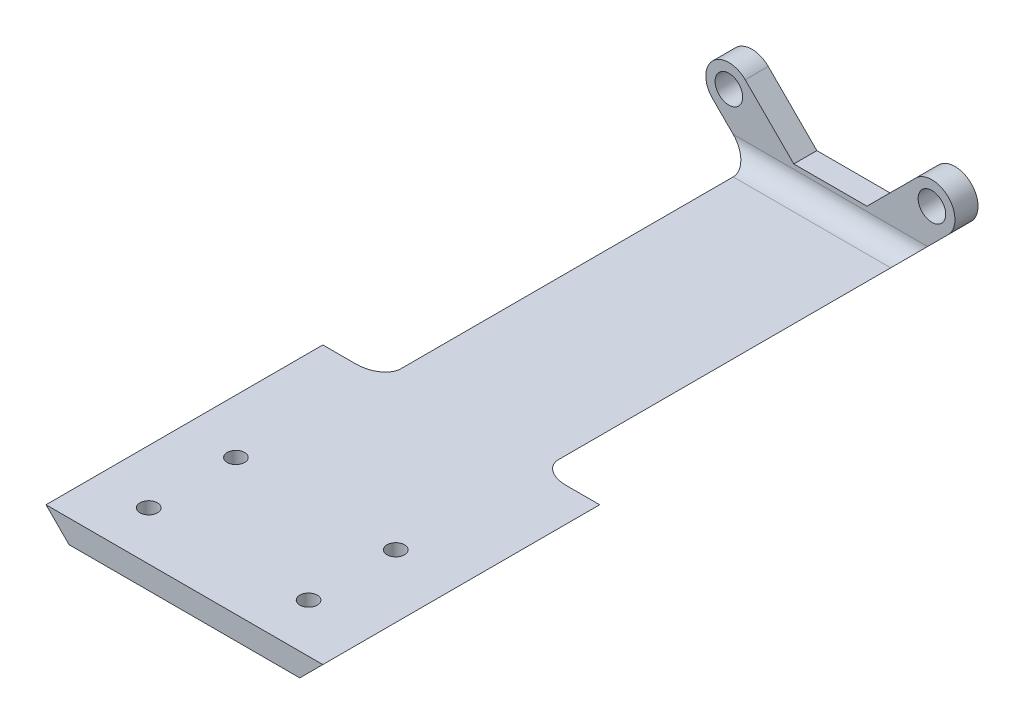
ISO-10303-21;
HEADER;
FILE_DESCRIPTION(('STEP AP214'),'2;1');
FILE_NAME('part.step','',(''),(''),'','','');
FILE_SCHEMA(('AUTOMOTIVE_DESIGN { 1 0 10303 214 1 1 1 1 }'));
ENDSEC;
DATA;
#1=APPLICATION_CONTEXT('core data for automotive mechanical design processes');
#2=APPLICATION_PROTOCOL_DEFINITION('international standard','automotive_design',2000,#1);
#3=PRODUCT_CONTEXT('',#1,'mechanical');
#4=PRODUCT('Part','Part','',(#3));
#5=PRODUCT_RELATED_PRODUCT_CATEGORY('part','',(#4));
#6=PRODUCT_DEFINITION_FORMATION('','',#4);
#7=PRODUCT_DEFINITION_CONTEXT('part definition',#1,'design');
#8=PRODUCT_DEFINITION('design','',#6,#7);
#9=PRODUCT_DEFINITION_SHAPE('','',#8);
#10=(LENGTH_UNIT() NAMED_UNIT(*) SI_UNIT(.MILLI.,.METRE.));
#11=(NAMED_UNIT(*) PLANE_ANGLE_UNIT() SI_UNIT($,.RADIAN.));
#12=(NAMED_UNIT(*) SI_UNIT($,.STERADIAN.) SOLID_ANGLE_UNIT());
#13=UNCERTAINTY_MEASURE_WITH_UNIT(LENGTH_MEASURE(1.E-05),#10,'distance_accuracy_value','');
#14=(GEOMETRIC_REPRESENTATION_CONTEXT(3) GLOBAL_UNCERTAINTY_ASSIGNED_CONTEXT((#13)) GLOBAL_UNIT_ASSIGNED_CONTEXT((#10,
#11,#12)) REPRESENTATION_CONTEXT('',''));
#15=CARTESIAN_POINT('',(0.,0.,0.));
#16=DIRECTION('',(0.,0.,1.));
#17=DIRECTION('',(1.,0.,0.));
#18=AXIS2_PLACEMENT_3D('',#15,#16,#17);
#19=CARTESIAN_POINT('',(0.,0.,3.175));
#20=DIRECTION('',(0.,0.,-1.));
#21=DIRECTION('',(-1.,0.,0.));
#22=AXIS2_PLACEMENT_3D('',#19,#20,#21);
#23=CYLINDRICAL_SURFACE('',#22,3.175);
#24=CARTESIAN_POINT('',(0.,0.,0.));
#25=DIRECTION('',(0.,0.,1.));
#26=DIRECTION('',(-1.,0.,0.));
#27=AXIS2_PLACEMENT_3D('',#24,#25,#26);
#28=CIRCLE('',#27,3.175);
#29=CARTESIAN_POINT('',(2.24506403026729,2.24506403026729,0.));
#30=VERTEX_POINT('',#29);
#31=CARTESIAN_POINT('',(-2.24506403026729,-2.24506403026729,0.));
#32=VERTEX_POINT('',#31);
#33=EDGE_CURVE('E247',#30,#32,#28,.T.);
#34=ORIENTED_EDGE('',*,*,#33,.T.);
#35=DIRECTION('',(0.,0.,-1.));
#36=VECTOR('',#35,1.);
#37=CARTESIAN_POINT('',(-2.24506403026729,-2.24506403026729,3.175));
#38=LINE('',#37,#36);
#39=CARTESIAN_POINT('',(-2.24506403026729,-2.24506403026729,3.175));
#40=VERTEX_POINT('',#39);
#41=EDGE_CURVE('E211',#40,#32,#38,.T.);
#42=ORIENTED_EDGE('',*,*,#41,.F.);
#43=CARTESIAN_POINT('',(0.,0.,3.175));
#44=DIRECTION('',(0.,0.,1.));
#45=DIRECTION('',(-1.,0.,0.));
#46=AXIS2_PLACEMENT_3D('',#43,#44,#45);
#47=CIRCLE('',#46,3.175);
#48=CARTESIAN_POINT('',(2.24506403026729,2.24506403026729,3.175));
#49=VERTEX_POINT('',#48);
#50=EDGE_CURVE('E266',#49,#40,#47,.T.);
#51=ORIENTED_EDGE('',*,*,#50,.F.);
#52=DIRECTION('',(0.,0.,-1.));
#53=VECTOR('',#52,1.);
#54=CARTESIAN_POINT('',(2.24506403026729,2.24506403026729,3.175));
#55=LINE('',#54,#53);
#56=EDGE_CURVE('E246',#49,#30,#55,.T.);
#57=ORIENTED_EDGE('',*,*,#56,.T.);
#58=EDGE_LOOP('',(#34,#42,#51,#57));
#59=FACE_BOUND('',#58,.T.);
#60=ADVANCED_FACE('F35',(#59),#23,.T.);
#61=CARTESIAN_POINT('',(-2.24506403026729,-2.24506403026729,3.175));
#62=DIRECTION('',(0.707106781186547,0.707106781186548,0.));
#63=DIRECTION('',(-0.707106781186548,0.707106781186547,0.));
#64=AXIS2_PLACEMENT_3D('',#61,#62,#63);
#65=PLANE('',#64);
#66=DIRECTION('',(0.,0.,-1.));
#67=VECTOR('',#66,1.);
#68=CARTESIAN_POINT('',(6.30487193946542,-10.795,3.175));
#69=LINE('',#68,#67);
#70=CARTESIAN_POINT('',(6.30487193946542,-10.795,51.435));
#71=VERTEX_POINT('',#70);
#72=CARTESIAN_POINT('',(6.30487193946542,-10.795,0.));
#73=VERTEX_POINT('',#72);
#74=EDGE_CURVE('E209',#71,#73,#69,.T.);
#75=ORIENTED_EDGE('',*,*,#74,.F.);
#76=DIRECTION('',(0.707106781186548,-0.707106781186547,0.));
#77=VECTOR('',#76,1.);
#78=CARTESIAN_POINT('',(3.12987193946542,-7.62,51.435));
#79=LINE('',#78,#77);
#80=CARTESIAN_POINT('',(3.12987193946543,-7.62,51.435));
#81=VERTEX_POINT('',#80);
#82=EDGE_CURVE('E207',#71,#81,#79,.F.);
#83=ORIENTED_EDGE('',*,*,#82,.T.);
#84=DIRECTION('',(0.,0.,-1.));
#85=VECTOR('',#84,1.);
#86=CARTESIAN_POINT('',(3.12987193946543,-7.62,53.975));
#87=LINE('',#86,#85);
#88=CARTESIAN_POINT('',(3.12987193946543,-7.62,5.715));
#89=VERTEX_POINT('',#88);
#90=EDGE_CURVE('E213',#81,#89,#87,.T.);
#91=ORIENTED_EDGE('',*,*,#90,.T.);
#92=CARTESIAN_POINT('',(0.589871939465422,-5.08,5.715));
#93=DIRECTION('',(0.707106781186547,0.707106781186548,0.));
#94=DIRECTION('',(0.707106781186548,-0.707106781186547,0.));
#95=AXIS2_PLACEMENT_3D('',#92,#93,#94);
#96=ELLIPSE('',#95,3.59210244842766,2.54);
#97=CARTESIAN_POINT('',(0.589871939465422,-5.08,3.175));
#98=VERTEX_POINT('',#97);
#99=EDGE_CURVE('E208',#89,#98,#96,.T.);
#100=ORIENTED_EDGE('',*,*,#99,.T.);
#101=DIRECTION('',(0.707106781186548,-0.707106781186547,0.));
#102=VECTOR('',#101,1.);
#103=CARTESIAN_POINT('',(-2.24506403026729,-2.24506403026729,3.175));
#104=LINE('',#103,#102);
#105=EDGE_CURVE('E231',#40,#98,#104,.T.);
#106=ORIENTED_EDGE('',*,*,#105,.F.);
#107=ORIENTED_EDGE('',*,*,#41,.T.);
#108=DIRECTION('',(0.707106781186548,-0.707106781186547,0.));
#109=VECTOR('',#108,1.);
#110=CARTESIAN_POINT('',(-2.24506403026729,-2.24506403026729,0.));
#111=LINE('',#110,#109);
#112=EDGE_CURVE('E250',#32,#73,#111,.T.);
#113=ORIENTED_EDGE('',*,*,#112,.T.);
#114=EDGE_LOOP('',(#75,#83,#91,#100,#106,#107,#113));
#115=FACE_BOUND('',#114,.T.);
#116=ADVANCED_FACE('F307',(#115),#65,.F.);
#117=CARTESIAN_POINT('',(6.30487193946542,-10.795,3.175));
#118=DIRECTION('',(0.,1.,0.));
#119=DIRECTION('',(0.,0.,1.));
#120=AXIS2_PLACEMENT_3D('',#117,#118,#119);
#121=PLANE('',#120);
#122=CARTESIAN_POINT('',(2.3543052808631,-10.795,85.375));
#123=DIRECTION('',(0.,1.,0.));
#124=DIRECTION('',(0.,0.,1.));
#125=AXIS2_PLACEMENT_3D('',#122,#123,#124);
#126=CIRCLE('',#125,1.19999999999999);
#127=CARTESIAN_POINT('',(2.3543052808631,-10.795,86.575));
#128=VERTEX_POINT('',#127);
#129=EDGE_CURVE('E347',#128,#128,#126,.T.);
#130=ORIENTED_EDGE('',*,*,#129,.T.);
#131=EDGE_LOOP('',(#130));
#132=FACE_BOUND('',#131,.T.);
#133=CARTESIAN_POINT('',(2.3543052808631,-10.795,73.375));
#134=DIRECTION('',(0.,1.,0.));
#135=DIRECTION('',(0.,0.,1.));
#136=AXIS2_PLACEMENT_3D('',#133,#134,#135);
#137=CIRCLE('',#136,1.19999999999999);
#138=CARTESIAN_POINT('',(2.3543052808631,-10.795,74.575));
#139=VERTEX_POINT('',#138);
#140=EDGE_CURVE('E341',#139,#139,#137,.T.);
#141=ORIENTED_EDGE('',*,*,#140,.T.);
#142=EDGE_LOOP('',(#141));
#143=FACE_BOUND('',#142,.T.);
#144=CARTESIAN_POINT('',(24.3543052808631,-10.795,85.375));
#145=DIRECTION('',(0.,1.,0.));
#146=DIRECTION('',(0.,0.,1.));
#147=AXIS2_PLACEMENT_3D('',#144,#145,#146);
#148=CIRCLE('',#147,1.19999999999999);
#149=CARTESIAN_POINT('',(24.3543052808631,-10.795,86.575));
#150=VERTEX_POINT('',#149);
#151=EDGE_CURVE('E335',#150,#150,#148,.T.);
#152=ORIENTED_EDGE('',*,*,#151,.T.);
#153=EDGE_LOOP('',(#152));
#154=FACE_BOUND('',#153,.T.);
#155=CARTESIAN_POINT('',(24.3543052808631,-10.795,73.375));
#156=DIRECTION('',(0.,1.,0.));
#157=DIRECTION('',(0.,0.,1.));
#158=AXIS2_PLACEMENT_3D('',#155,#156,#157);
#159=CIRCLE('',#158,1.19999999999999);
#160=CARTESIAN_POINT('',(24.3543052808631,-10.795,74.575));
#161=VERTEX_POINT('',#160);
#162=EDGE_CURVE('E327',#161,#161,#159,.T.);
#163=ORIENTED_EDGE('',*,*,#162,.T.);
#164=EDGE_LOOP('',(#163));
#165=FACE_BOUND('',#164,.T.);
#166=DIRECTION('',(1.,0.,0.));
#167=VECTOR('',#166,1.);
#168=CARTESIAN_POINT('',(6.30487193946542,-10.795,0.));
#169=LINE('',#168,#167);
#170=CARTESIAN_POINT('',(21.6351280605346,-10.795,0.));
#171=VERTEX_POINT('',#170);
#172=EDGE_CURVE('E254',#73,#171,#169,.T.);
#173=ORIENTED_EDGE('',*,*,#172,.T.);
#174=DIRECTION('',(0.,0.,-1.));
#175=VECTOR('',#174,1.);
#176=CARTESIAN_POINT('',(21.6351280605346,-10.795,3.175));
#177=LINE('',#176,#175);
#178=CARTESIAN_POINT('',(21.6351280605346,-10.795,51.435));
#179=VERTEX_POINT('',#178);
#180=EDGE_CURVE('E212',#179,#171,#177,.T.);
#181=ORIENTED_EDGE('',*,*,#180,.F.);
#182=CARTESIAN_POINT('',(25.2272305089622,-10.795,51.435));
#183=DIRECTION('',(0.,1.,0.));
#184=DIRECTION('',(-1.,0.,0.));
#185=AXIS2_PLACEMENT_3D('',#182,#183,#184);
#186=ELLIPSE('',#185,3.59210244842766,2.54);
#187=CARTESIAN_POINT('',(25.2272305089622,-10.795,53.975));
#188=VERTEX_POINT('',#187);
#189=EDGE_CURVE('E11',#179,#188,#186,.T.);
#190=ORIENTED_EDGE('',*,*,#189,.T.);
#191=DIRECTION('',(1.,0.,0.));
#192=VECTOR('',#191,1.);
#193=CARTESIAN_POINT('',(29.8449950394654,-10.795,53.975));
#194=LINE('',#193,#192);
#195=CARTESIAN_POINT('',(29.8449950394654,-10.795,53.975));
#196=VERTEX_POINT('',#195);
#197=EDGE_CURVE('E322',#188,#196,#194,.T.);
#198=ORIENTED_EDGE('',*,*,#197,.T.);
#199=DIRECTION('',(0.,0.,-1.));
#200=VECTOR('',#199,1.);
#201=CARTESIAN_POINT('',(29.8449950394654,-10.795,92.075));
#202=LINE('',#201,#200);
#203=CARTESIAN_POINT('',(29.8449950394654,-10.795,92.075));
#204=VERTEX_POINT('',#203);
#205=EDGE_CURVE('E161',#204,#196,#202,.T.);
#206=ORIENTED_EDGE('',*,*,#205,.F.);
#207=DIRECTION('',(1.,0.,0.));
#208=VECTOR('',#207,1.);
#209=CARTESIAN_POINT('',(29.8449950394654,-10.795,92.075));
#210=LINE('',#209,#208);
#211=CARTESIAN_POINT('',(-1.90500496053457,-10.795,92.075));
#212=VERTEX_POINT('',#211);
#213=EDGE_CURVE('E152',#212,#204,#210,.T.);
#214=ORIENTED_EDGE('',*,*,#213,.F.);
#215=DIRECTION('',(0.,0.,-1.));
#216=VECTOR('',#215,1.);
#217=CARTESIAN_POINT('',(-1.90500496053457,-10.795,92.075));
#218=LINE('',#217,#216);
#219=CARTESIAN_POINT('',(-1.90500496053457,-10.795,53.975));
#220=VERTEX_POINT('',#219);
#221=EDGE_CURVE('E158',#212,#220,#218,.T.);
#222=ORIENTED_EDGE('',*,*,#221,.T.);
#223=CARTESIAN_POINT('',(2.71276949103777,-10.795,53.975));
#224=VERTEX_POINT('',#223);
#225=EDGE_CURVE('E191',#220,#224,#194,.T.);
#226=ORIENTED_EDGE('',*,*,#225,.T.);
#227=CARTESIAN_POINT('',(2.71276949103777,-10.795,51.435));
#228=DIRECTION('',(0.,1.,0.));
#229=DIRECTION('',(-1.,0.,0.));
#230=AXIS2_PLACEMENT_3D('',#227,#228,#229);
#231=ELLIPSE('',#230,3.59210244842766,2.54);
#232=EDGE_CURVE('E292',#224,#71,#231,.T.);
#233=ORIENTED_EDGE('',*,*,#232,.T.);
#234=ORIENTED_EDGE('',*,*,#74,.T.);
#235=EDGE_LOOP('',(#173,#181,#190,#198,#206,#214,#222,#226,#233,#234));
#236=FACE_BOUND('',#235,.T.);
#237=ADVANCED_FACE('F155',(#132,#143,#154,#165,#236),#121,.F.);
#238=CARTESIAN_POINT('',(21.6351280605346,-10.795,3.175));
#239=DIRECTION('',(-0.707106781186547,0.707106781186548,0.));
#240=DIRECTION('',(-0.707106781186548,-0.707106781186547,0.));
#241=AXIS2_PLACEMENT_3D('',#238,#239,#240);
#242=PLANE('',#241);
#243=DIRECTION('',(0.,0.,-1.));
#244=VECTOR('',#243,1.);
#245=CARTESIAN_POINT('',(24.8101280605346,-7.62,53.975));
#246=LINE('',#245,#244);
#247=CARTESIAN_POINT('',(24.8101280605346,-7.62,51.435));
#248=VERTEX_POINT('',#247);
#249=CARTESIAN_POINT('',(24.8101280605346,-7.62,5.715));
#250=VERTEX_POINT('',#249);
#251=EDGE_CURVE('E251',#248,#250,#246,.T.);
#252=ORIENTED_EDGE('',*,*,#251,.F.);
#253=DIRECTION('',(0.707106781186548,0.707106781186547,0.));
#254=VECTOR('',#253,1.);
#255=CARTESIAN_POINT('',(21.6351280605346,-10.795,51.435));
#256=LINE('',#255,#254);
#257=EDGE_CURVE('E50',#248,#179,#256,.F.);
#258=ORIENTED_EDGE('',*,*,#257,.T.);
#259=ORIENTED_EDGE('',*,*,#180,.T.);
#260=DIRECTION('',(0.707106781186548,0.707106781186547,0.));
#261=VECTOR('',#260,1.);
#262=CARTESIAN_POINT('',(21.6351280605346,-10.795,0.));
#263=LINE('',#262,#261);
#264=CARTESIAN_POINT('',(30.1850640302673,-2.24506403026729,0.));
#265=VERTEX_POINT('',#264);
#266=EDGE_CURVE('E256',#171,#265,#263,.T.);
#267=ORIENTED_EDGE('',*,*,#266,.T.);
#268=DIRECTION('',(0.,0.,-1.));
#269=VECTOR('',#268,1.);
#270=CARTESIAN_POINT('',(30.1850640302673,-2.24506403026729,3.175));
#271=LINE('',#270,#269);
#272=CARTESIAN_POINT('',(30.1850640302673,-2.24506403026729,3.175));
#273=VERTEX_POINT('',#272);
#274=EDGE_CURVE('E278',#273,#265,#271,.T.);
#275=ORIENTED_EDGE('',*,*,#274,.F.);
#276=DIRECTION('',(0.707106781186548,0.707106781186547,0.));
#277=VECTOR('',#276,1.);
#278=CARTESIAN_POINT('',(21.6351280605346,-10.795,3.175));
#279=LINE('',#278,#277);
#280=CARTESIAN_POINT('',(27.3501280605346,-5.08,3.175));
#281=VERTEX_POINT('',#280);
#282=EDGE_CURVE('E228',#281,#273,#279,.T.);
#283=ORIENTED_EDGE('',*,*,#282,.F.);
#284=CARTESIAN_POINT('',(27.3501280605346,-5.08,5.715));
#285=DIRECTION('',(-0.707106781186547,0.707106781186548,0.));
#286=DIRECTION('',(0.707106781186548,0.707106781186547,0.));
#287=AXIS2_PLACEMENT_3D('',#284,#285,#286);
#288=ELLIPSE('',#287,3.59210244842766,2.54);
#289=EDGE_CURVE('E219',#281,#250,#288,.T.);
#290=ORIENTED_EDGE('',*,*,#289,.T.);
#291=EDGE_LOOP('',(#252,#258,#259,#267,#275,#283,#290));
#292=FACE_BOUND('',#291,.T.);
#293=ADVANCED_FACE('F375',(#292),#242,.F.);
#294=CARTESIAN_POINT('',(27.94,0.,3.175));
#295=DIRECTION('',(0.,0.,-1.));
#296=DIRECTION('',(-1.,0.,0.));
#297=AXIS2_PLACEMENT_3D('',#294,#295,#296);
#298=CYLINDRICAL_SURFACE('',#297,3.175);
#299=CARTESIAN_POINT('',(27.94,0.,0.));
#300=DIRECTION('',(0.,0.,1.));
#301=DIRECTION('',(1.,0.,0.));
#302=AXIS2_PLACEMENT_3D('',#299,#300,#301);
#303=CIRCLE('',#302,3.175);
#304=CARTESIAN_POINT('',(25.6949359697327,2.24506403026729,0.));
#305=VERTEX_POINT('',#304);
#306=EDGE_CURVE('E258',#265,#305,#303,.T.);
#307=ORIENTED_EDGE('',*,*,#306,.T.);
#308=DIRECTION('',(0.,0.,-1.));
#309=VECTOR('',#308,1.);
#310=CARTESIAN_POINT('',(25.6949359697327,2.24506403026729,3.175));
#311=LINE('',#310,#309);
#312=CARTESIAN_POINT('',(25.6949359697327,2.24506403026729,3.175));
#313=VERTEX_POINT('',#312);
#314=EDGE_CURVE('E275',#313,#305,#311,.T.);
#315=ORIENTED_EDGE('',*,*,#314,.F.);
#316=CARTESIAN_POINT('',(27.94,0.,3.175));
#317=DIRECTION('',(0.,0.,1.));
#318=DIRECTION('',(1.,0.,0.));
#319=AXIS2_PLACEMENT_3D('',#316,#317,#318);
#320=CIRCLE('',#319,3.175);
#321=EDGE_CURVE('E230',#273,#313,#320,.T.);
#322=ORIENTED_EDGE('',*,*,#321,.F.);
#323=ORIENTED_EDGE('',*,*,#274,.T.);
#324=EDGE_LOOP('',(#307,#315,#322,#323));
#325=FACE_BOUND('',#324,.T.);
#326=ADVANCED_FACE('F382',(#325),#298,.T.);
#327=CARTESIAN_POINT('',(19.0048719394654,-4.445,3.175));
#328=DIRECTION('',(0.707106781186548,-0.707106781186547,0.));
#329=DIRECTION('',(0.707106781186547,0.707106781186548,0.));
#330=AXIS2_PLACEMENT_3D('',#327,#328,#329);
#331=PLANE('',#330);
#332=DIRECTION('',(-0.707106781186547,-0.707106781186548,0.));
#333=VECTOR('',#332,1.);
#334=CARTESIAN_POINT('',(19.0048719394654,-4.445,0.));
#335=LINE('',#334,#333);
#336=CARTESIAN_POINT('',(19.0048719394654,-4.445,0.));
#337=VERTEX_POINT('',#336);
#338=EDGE_CURVE('E260',#305,#337,#335,.T.);
#339=ORIENTED_EDGE('',*,*,#338,.T.);
#340=DIRECTION('',(0.,0.,-1.));
#341=VECTOR('',#340,1.);
#342=CARTESIAN_POINT('',(19.0048719394654,-4.445,3.175));
#343=LINE('',#342,#341);
#344=CARTESIAN_POINT('',(19.0048719394654,-4.445,3.175));
#345=VERTEX_POINT('',#344);
#346=EDGE_CURVE('E272',#345,#337,#343,.T.);
#347=ORIENTED_EDGE('',*,*,#346,.F.);
#348=DIRECTION('',(-0.707106781186547,-0.707106781186548,0.));
#349=VECTOR('',#348,1.);
#350=CARTESIAN_POINT('',(19.0048719394654,-4.445,3.175));
#351=LINE('',#350,#349);
#352=EDGE_CURVE('E240',#313,#345,#351,.T.);
#353=ORIENTED_EDGE('',*,*,#352,.F.);
#354=ORIENTED_EDGE('',*,*,#314,.T.);
#355=EDGE_LOOP('',(#339,#347,#353,#354));
#356=FACE_BOUND('',#355,.T.);
#357=ADVANCED_FACE('F435',(#356),#331,.F.);
#358=CARTESIAN_POINT('',(8.93512806053458,-4.445,3.175));
#359=DIRECTION('',(0.,-1.,0.));
#360=DIRECTION('',(0.,0.,-1.));
#361=AXIS2_PLACEMENT_3D('',#358,#359,#360);
#362=PLANE('',#361);
#363=DIRECTION('',(-1.,0.,0.));
#364=VECTOR('',#363,1.);
#365=CARTESIAN_POINT('',(8.93512806053458,-4.445,0.));
#366=LINE('',#365,#364);
#367=CARTESIAN_POINT('',(8.93512806053458,-4.445,0.));
#368=VERTEX_POINT('',#367);
#369=EDGE_CURVE('E262',#337,#368,#366,.T.);
#370=ORIENTED_EDGE('',*,*,#369,.T.);
#371=DIRECTION('',(0.,0.,-1.));
#372=VECTOR('',#371,1.);
#373=CARTESIAN_POINT('',(8.93512806053458,-4.445,3.175));
#374=LINE('',#373,#372);
#375=CARTESIAN_POINT('',(8.93512806053458,-4.445,3.175));
#376=VERTEX_POINT('',#375);
#377=EDGE_CURVE('E269',#376,#368,#374,.T.);
#378=ORIENTED_EDGE('',*,*,#377,.F.);
#379=DIRECTION('',(-1.,0.,0.));
#380=VECTOR('',#379,1.);
#381=CARTESIAN_POINT('',(8.93512806053458,-4.445,3.175));
#382=LINE('',#381,#380);
#383=EDGE_CURVE('E242',#345,#376,#382,.T.);
#384=ORIENTED_EDGE('',*,*,#383,.F.);
#385=ORIENTED_EDGE('',*,*,#346,.T.);
#386=EDGE_LOOP('',(#370,#378,#384,#385));
#387=FACE_BOUND('',#386,.T.);
#388=ADVANCED_FACE('F431',(#387),#362,.F.);
#389=CARTESIAN_POINT('',(2.24506403026729,2.24506403026729,3.175));
#390=DIRECTION('',(-0.707106781186548,-0.707106781186548,0.));
#391=DIRECTION('',(0.707106781186548,-0.707106781186548,0.));
#392=AXIS2_PLACEMENT_3D('',#389,#390,#391);
#393=PLANE('',#392);
#394=DIRECTION('',(-0.707106781186547,0.707106781186547,0.));
#395=VECTOR('',#394,1.);
#396=CARTESIAN_POINT('',(2.24506403026729,2.24506403026729,0.));
#397=LINE('',#396,#395);
#398=EDGE_CURVE('E264',#368,#30,#397,.T.);
#399=ORIENTED_EDGE('',*,*,#398,.T.);
#400=ORIENTED_EDGE('',*,*,#56,.F.);
#401=DIRECTION('',(-0.707106781186547,0.707106781186547,0.));
#402=VECTOR('',#401,1.);
#403=CARTESIAN_POINT('',(2.24506403026729,2.24506403026729,3.175));
#404=LINE('',#403,#402);
#405=EDGE_CURVE('E244',#376,#49,#404,.T.);
#406=ORIENTED_EDGE('',*,*,#405,.F.);
#407=ORIENTED_EDGE('',*,*,#377,.T.);
#408=EDGE_LOOP('',(#399,#400,#406,#407));
#409=FACE_BOUND('',#408,.T.);
#410=ADVANCED_FACE('F424',(#409),#393,.F.);
#411=CARTESIAN_POINT('',(0.,0.,3.175));
#412=DIRECTION('',(0.,0.,-1.));
#413=DIRECTION('',(-1.,0.,0.));
#414=AXIS2_PLACEMENT_3D('',#411,#412,#413);
#415=PLANE('',#414);
#416=CARTESIAN_POINT('',(27.94,0.,3.175));
#417=DIRECTION('',(0.,0.,-1.));
#418=DIRECTION('',(-1.,0.,0.));
#419=AXIS2_PLACEMENT_3D('',#416,#417,#418);
#420=CIRCLE('',#419,1.89864999999999);
#421=CARTESIAN_POINT('',(26.04135,0.,3.175));
#422=VERTEX_POINT('',#421);
#423=EDGE_CURVE('E182',#422,#422,#420,.T.);
#424=ORIENTED_EDGE('',*,*,#423,.T.);
#425=EDGE_LOOP('',(#424));
#426=FACE_BOUND('',#425,.T.);
#427=CARTESIAN_POINT('',(0.,0.,3.175));
#428=DIRECTION('',(0.,0.,-1.));
#429=DIRECTION('',(-1.,0.,0.));
#430=AXIS2_PLACEMENT_3D('',#427,#428,#429);
#431=CIRCLE('',#430,1.89864999999999);
#432=CARTESIAN_POINT('',(-1.89864999999999,0.,3.175));
#433=VERTEX_POINT('',#432);
#434=EDGE_CURVE('E463',#433,#433,#431,.T.);
#435=ORIENTED_EDGE('',*,*,#434,.T.);
#436=EDGE_LOOP('',(#435));
#437=FACE_BOUND('',#436,.T.);
#438=ORIENTED_EDGE('',*,*,#105,.T.);
#439=DIRECTION('',(1.,0.,0.));
#440=VECTOR('',#439,1.);
#441=CARTESIAN_POINT('',(0.,-5.08,3.175));
#442=LINE('',#441,#440);
#443=EDGE_CURVE('E225',#98,#281,#442,.T.);
#444=ORIENTED_EDGE('',*,*,#443,.T.);
#445=ORIENTED_EDGE('',*,*,#282,.T.);
#446=ORIENTED_EDGE('',*,*,#321,.T.);
#447=ORIENTED_EDGE('',*,*,#352,.T.);
#448=ORIENTED_EDGE('',*,*,#383,.T.);
#449=ORIENTED_EDGE('',*,*,#405,.T.);
#450=ORIENTED_EDGE('',*,*,#50,.T.);
#451=EDGE_LOOP('',(#438,#444,#445,#446,#447,#448,#449,#450));
#452=FACE_BOUND('',#451,.T.);
#453=ADVANCED_FACE('F421',(#426,#437,#452),#415,.F.);
#454=CARTESIAN_POINT('',(0.,0.,0.));
#455=DIRECTION('',(0.,0.,-1.));
#456=DIRECTION('',(-1.,0.,0.));
#457=AXIS2_PLACEMENT_3D('',#454,#455,#456);
#458=PLANE('',#457);
#459=CARTESIAN_POINT('',(27.94,0.,0.));
#460=DIRECTION('',(0.,0.,-1.));
#461=DIRECTION('',(-1.,0.,0.));
#462=AXIS2_PLACEMENT_3D('',#459,#460,#461);
#463=CIRCLE('',#462,1.89864999999999);
#464=CARTESIAN_POINT('',(26.04135,0.,0.));
#465=VERTEX_POINT('',#464);
#466=EDGE_CURVE('E179',#465,#465,#463,.T.);
#467=ORIENTED_EDGE('',*,*,#466,.F.);
#468=EDGE_LOOP('',(#467));
#469=FACE_BOUND('',#468,.T.);
#470=CARTESIAN_POINT('',(0.,0.,0.));
#471=DIRECTION('',(0.,0.,-1.));
#472=DIRECTION('',(-1.,0.,0.));
#473=AXIS2_PLACEMENT_3D('',#470,#471,#472);
#474=CIRCLE('',#473,1.89864999999999);
#475=CARTESIAN_POINT('',(-1.89864999999999,0.,0.));
#476=VERTEX_POINT('',#475);
#477=EDGE_CURVE('E465',#476,#476,#474,.T.);
#478=ORIENTED_EDGE('',*,*,#477,.F.);
#479=EDGE_LOOP('',(#478));
#480=FACE_BOUND('',#479,.T.);
#481=ORIENTED_EDGE('',*,*,#33,.F.);
#482=ORIENTED_EDGE('',*,*,#398,.F.);
#483=ORIENTED_EDGE('',*,*,#369,.F.);
#484=ORIENTED_EDGE('',*,*,#338,.F.);
#485=ORIENTED_EDGE('',*,*,#306,.F.);
#486=ORIENTED_EDGE('',*,*,#266,.F.);
#487=ORIENTED_EDGE('',*,*,#172,.F.);
#488=ORIENTED_EDGE('',*,*,#112,.F.);
#489=EDGE_LOOP('',(#481,#482,#483,#484,#485,#486,#487,#488));
#490=FACE_BOUND('',#489,.T.);
#491=ADVANCED_FACE('F313',(#469,#480,#490),#458,.T.);
#492=CARTESIAN_POINT('',(13.97,-7.62,53.975));
#493=DIRECTION('',(0.,1.,0.));
#494=DIRECTION('',(0.,0.,1.));
#495=AXIS2_PLACEMENT_3D('',#492,#493,#494);
#496=PLANE('',#495);
#497=CARTESIAN_POINT('',(2.3543052808631,-7.62,85.375));
#498=DIRECTION('',(0.,1.,0.));
#499=DIRECTION('',(0.,0.,1.));
#500=AXIS2_PLACEMENT_3D('',#497,#498,#499);
#501=CIRCLE('',#500,1.19999999999999);
#502=CARTESIAN_POINT('',(2.3543052808631,-7.62,86.575));
#503=VERTEX_POINT('',#502);
#504=EDGE_CURVE('E350',#503,#503,#501,.T.);
#505=ORIENTED_EDGE('',*,*,#504,.F.);
#506=EDGE_LOOP('',(#505));
#507=FACE_BOUND('',#506,.T.);
#508=CARTESIAN_POINT('',(2.3543052808631,-7.62,73.375));
#509=DIRECTION('',(0.,1.,0.));
#510=DIRECTION('',(0.,0.,1.));
#511=AXIS2_PLACEMENT_3D('',#508,#509,#510);
#512=CIRCLE('',#511,1.19999999999999);
#513=CARTESIAN_POINT('',(2.3543052808631,-7.62,74.575));
#514=VERTEX_POINT('',#513);
#515=EDGE_CURVE('E344',#514,#514,#512,.T.);
#516=ORIENTED_EDGE('',*,*,#515,.F.);
#517=EDGE_LOOP('',(#516));
#518=FACE_BOUND('',#517,.T.);
#519=CARTESIAN_POINT('',(24.3543052808631,-7.62,85.375));
#520=DIRECTION('',(0.,1.,0.));
#521=DIRECTION('',(0.,0.,1.));
#522=AXIS2_PLACEMENT_3D('',#519,#520,#521);
#523=CIRCLE('',#522,1.19999999999999);
#524=CARTESIAN_POINT('',(24.3543052808631,-7.62,86.575));
#525=VERTEX_POINT('',#524);
#526=EDGE_CURVE('E338',#525,#525,#523,.T.);
#527=ORIENTED_EDGE('',*,*,#526,.F.);
#528=EDGE_LOOP('',(#527));
#529=FACE_BOUND('',#528,.T.);
#530=CARTESIAN_POINT('',(24.3543052808631,-7.62,73.375));
#531=DIRECTION('',(0.,1.,0.));
#532=DIRECTION('',(0.,0.,1.));
#533=AXIS2_PLACEMENT_3D('',#530,#531,#532);
#534=CIRCLE('',#533,1.19999999999999);
#535=CARTESIAN_POINT('',(24.3543052808631,-7.62,74.575));
#536=VERTEX_POINT('',#535);
#537=EDGE_CURVE('E332',#536,#536,#534,.T.);
#538=ORIENTED_EDGE('',*,*,#537,.F.);
#539=EDGE_LOOP('',(#538));
#540=FACE_BOUND('',#539,.T.);
#541=DIRECTION('',(-1.,0.,0.));
#542=VECTOR('',#541,1.);
#543=CARTESIAN_POINT('',(-5.08000496053457,-7.62,53.975));
#544=LINE('',#543,#542);
#545=CARTESIAN_POINT('',(33.0199950394654,-7.62,53.975));
#546=VERTEX_POINT('',#545);
#547=CARTESIAN_POINT('',(28.4022305089622,-7.62,53.975));
#548=VERTEX_POINT('',#547);
#549=EDGE_CURVE('E174',#546,#548,#544,.T.);
#550=ORIENTED_EDGE('',*,*,#549,.T.);
#551=CARTESIAN_POINT('',(28.4022305089622,-7.62,51.435));
#552=DIRECTION('',(0.,1.,0.));
#553=DIRECTION('',(-1.,0.,0.));
#554=AXIS2_PLACEMENT_3D('',#551,#552,#553);
#555=ELLIPSE('',#554,3.59210244842766,2.54);
#556=EDGE_CURVE('E43',#548,#248,#555,.F.);
#557=ORIENTED_EDGE('',*,*,#556,.T.);
#558=ORIENTED_EDGE('',*,*,#251,.T.);
#559=DIRECTION('',(1.,0.,0.));
#560=VECTOR('',#559,1.);
#561=CARTESIAN_POINT('',(13.97,-7.62,5.715));
#562=LINE('',#561,#560);
#563=EDGE_CURVE('E222',#250,#89,#562,.F.);
#564=ORIENTED_EDGE('',*,*,#563,.T.);
#565=ORIENTED_EDGE('',*,*,#90,.F.);
#566=CARTESIAN_POINT('',(-0.462230508962238,-7.62,51.435));
#567=DIRECTION('',(0.,1.,0.));
#568=DIRECTION('',(-1.,0.,0.));
#569=AXIS2_PLACEMENT_3D('',#566,#567,#568);
#570=ELLIPSE('',#569,3.59210244842766,2.54);
#571=CARTESIAN_POINT('',(-0.462230508962237,-7.62,53.975));
#572=VERTEX_POINT('',#571);
#573=EDGE_CURVE('E294',#81,#572,#570,.F.);
#574=ORIENTED_EDGE('',*,*,#573,.T.);
#575=CARTESIAN_POINT('',(-5.08000496053457,-7.62,53.975));
#576=VERTEX_POINT('',#575);
#577=EDGE_CURVE('E190',#572,#576,#544,.T.);
#578=ORIENTED_EDGE('',*,*,#577,.T.);
#579=DIRECTION('',(0.,0.,-1.));
#580=VECTOR('',#579,1.);
#581=CARTESIAN_POINT('',(-5.08000496053457,-7.62,92.075));
#582=LINE('',#581,#580);
#583=CARTESIAN_POINT('',(-5.08000496053457,-7.62,92.075));
#584=VERTEX_POINT('',#583);
#585=EDGE_CURVE('E197',#584,#576,#582,.T.);
#586=ORIENTED_EDGE('',*,*,#585,.F.);
#587=DIRECTION('',(-1.,0.,0.));
#588=VECTOR('',#587,1.);
#589=CARTESIAN_POINT('',(-5.08000496053457,-7.62,92.075));
#590=LINE('',#589,#588);
#591=CARTESIAN_POINT('',(33.0199950394654,-7.62,92.075));
#592=VERTEX_POINT('',#591);
#593=EDGE_CURVE('E170',#592,#584,#590,.T.);
#594=ORIENTED_EDGE('',*,*,#593,.F.);
#595=DIRECTION('',(0.,0.,-1.));
#596=VECTOR('',#595,1.);
#597=CARTESIAN_POINT('',(33.0199950394654,-7.62,92.075));
#598=LINE('',#597,#596);
#599=EDGE_CURVE('E184',#592,#546,#598,.T.);
#600=ORIENTED_EDGE('',*,*,#599,.T.);
#601=EDGE_LOOP('',(#550,#557,#558,#564,#565,#574,#578,#586,#594,#600));
#602=FACE_BOUND('',#601,.T.);
#603=ADVANCED_FACE('F298',(#507,#518,#529,#540,#602),#496,.T.);
#604=CARTESIAN_POINT('',(0.,-5.08,5.715));
#605=DIRECTION('',(1.,0.,0.));
#606=DIRECTION('',(0.,0.,-1.));
#607=AXIS2_PLACEMENT_3D('',#604,#605,#606);
#608=CYLINDRICAL_SURFACE('',#607,2.54);
#609=ORIENTED_EDGE('',*,*,#99,.F.);
#610=ORIENTED_EDGE('',*,*,#563,.F.);
#611=ORIENTED_EDGE('',*,*,#289,.F.);
#612=ORIENTED_EDGE('',*,*,#443,.F.);
#613=EDGE_LOOP('',(#609,#610,#611,#612));
#614=FACE_BOUND('',#613,.T.);
#615=ADVANCED_FACE('F359',(#614),#608,.F.);
#616=CARTESIAN_POINT('',(0.,0.,0.));
#617=DIRECTION('',(0.,0.,-1.));
#618=DIRECTION('',(-1.,0.,0.));
#619=AXIS2_PLACEMENT_3D('',#616,#617,#618);
#620=CYLINDRICAL_SURFACE('',#619,1.89864999999999);
#621=ORIENTED_EDGE('',*,*,#477,.T.);
#622=EDGE_LOOP('',(#621));
#623=FACE_BOUND('',#622,.T.);
#624=ORIENTED_EDGE('',*,*,#434,.F.);
#625=EDGE_LOOP('',(#624));
#626=FACE_BOUND('',#625,.T.);
#627=ADVANCED_FACE('F393',(#623,#626),#620,.F.);
#628=CARTESIAN_POINT('',(27.94,0.,0.));
#629=DIRECTION('',(0.,0.,-1.));
#630=DIRECTION('',(-1.,0.,0.));
#631=AXIS2_PLACEMENT_3D('',#628,#629,#630);
#632=CYLINDRICAL_SURFACE('',#631,1.89864999999999);
#633=ORIENTED_EDGE('',*,*,#466,.T.);
#634=EDGE_LOOP('',(#633));
#635=FACE_BOUND('',#634,.T.);
#636=ORIENTED_EDGE('',*,*,#423,.F.);
#637=EDGE_LOOP('',(#636));
#638=FACE_BOUND('',#637,.T.);
#639=ADVANCED_FACE('F411',(#635,#638),#632,.F.);
#640=CARTESIAN_POINT('',(13.9699950394654,-26.67,53.975));
#641=DIRECTION('',(0.,0.,1.));
#642=DIRECTION('',(1.,0.,0.));
#643=AXIS2_PLACEMENT_3D('',#640,#641,#642);
#644=PLANE('',#643);
#645=ORIENTED_EDGE('',*,*,#197,.F.);
#646=DIRECTION('',(0.707106781186548,0.707106781186547,0.));
#647=VECTOR('',#646,1.);
#648=CARTESIAN_POINT('',(26.6061792847484,-9.41605122421383,53.975));
#649=LINE('',#648,#647);
#650=EDGE_CURVE('E288',#188,#548,#649,.T.);
#651=ORIENTED_EDGE('',*,*,#650,.T.);
#652=ORIENTED_EDGE('',*,*,#549,.F.);
#653=DIRECTION('',(0.707106781186547,0.707106781186547,0.));
#654=VECTOR('',#653,1.);
#655=CARTESIAN_POINT('',(33.0199950394654,-7.62,53.975));
#656=LINE('',#655,#654);
#657=EDGE_CURVE('E196',#196,#546,#656,.T.);
#658=ORIENTED_EDGE('',*,*,#657,.F.);
#659=EDGE_LOOP('',(#645,#651,#652,#658));
#660=FACE_BOUND('',#659,.T.);
#661=ADVANCED_FACE('F409',(#660),#644,.F.);
#662=ORIENTED_EDGE('',*,*,#577,.F.);
#663=DIRECTION('',(0.707106781186548,-0.707106781186547,0.));
#664=VECTOR('',#663,1.);
#665=CARTESIAN_POINT('',(4.5088207152516,-12.5910512242138,53.975));
#666=LINE('',#665,#664);
#667=EDGE_CURVE('E204',#572,#224,#666,.T.);
#668=ORIENTED_EDGE('',*,*,#667,.T.);
#669=ORIENTED_EDGE('',*,*,#225,.F.);
#670=DIRECTION('',(0.707106781186548,-0.707106781186547,0.));
#671=VECTOR('',#670,1.);
#672=CARTESIAN_POINT('',(-1.90500496053457,-10.795,53.975));
#673=LINE('',#672,#671);
#674=EDGE_CURVE('E178',#576,#220,#673,.T.);
#675=ORIENTED_EDGE('',*,*,#674,.F.);
#676=EDGE_LOOP('',(#662,#668,#669,#675));
#677=FACE_BOUND('',#676,.T.);
#678=ADVANCED_FACE('F303',(#677),#644,.F.);
#679=CARTESIAN_POINT('',(-1.90500496053457,-10.795,92.075));
#680=DIRECTION('',(0.707106781186547,0.707106781186548,0.));
#681=DIRECTION('',(-0.707106781186548,0.707106781186547,0.));
#682=AXIS2_PLACEMENT_3D('',#679,#680,#681);
#683=PLANE('',#682);
#684=ORIENTED_EDGE('',*,*,#674,.T.);
#685=ORIENTED_EDGE('',*,*,#221,.F.);
#686=DIRECTION('',(0.707106781186548,-0.707106781186547,0.));
#687=VECTOR('',#686,1.);
#688=CARTESIAN_POINT('',(-1.90500496053457,-10.795,92.075));
#689=LINE('',#688,#687);
#690=EDGE_CURVE('E165',#584,#212,#689,.T.);
#691=ORIENTED_EDGE('',*,*,#690,.F.);
#692=ORIENTED_EDGE('',*,*,#585,.T.);
#693=EDGE_LOOP('',(#684,#685,#691,#692));
#694=FACE_BOUND('',#693,.T.);
#695=ADVANCED_FACE('F176',(#694),#683,.F.);
#696=CARTESIAN_POINT('',(33.0199950394654,-7.62,92.075));
#697=DIRECTION('',(-0.707106781186547,0.707106781186547,0.));
#698=DIRECTION('',(-0.707106781186548,-0.707106781186548,0.));
#699=AXIS2_PLACEMENT_3D('',#696,#697,#698);
#700=PLANE('',#699);
#701=ORIENTED_EDGE('',*,*,#657,.T.);
#702=ORIENTED_EDGE('',*,*,#599,.F.);
#703=DIRECTION('',(0.707106781186547,0.707106781186547,0.));
#704=VECTOR('',#703,1.);
#705=CARTESIAN_POINT('',(33.0199950394654,-7.62,92.075));
#706=LINE('',#705,#704);
#707=EDGE_CURVE('E164',#204,#592,#706,.T.);
#708=ORIENTED_EDGE('',*,*,#707,.F.);
#709=ORIENTED_EDGE('',*,*,#205,.T.);
#710=EDGE_LOOP('',(#701,#702,#708,#709));
#711=FACE_BOUND('',#710,.T.);
#712=ADVANCED_FACE('F400',(#711),#700,.F.);
#713=CARTESIAN_POINT('',(13.9699950394654,-26.67,92.075));
#714=DIRECTION('',(0.,0.,1.));
#715=DIRECTION('',(1.,0.,0.));
#716=AXIS2_PLACEMENT_3D('',#713,#714,#715);
#717=PLANE('',#716);
#718=ORIENTED_EDGE('',*,*,#690,.T.);
#719=ORIENTED_EDGE('',*,*,#213,.T.);
#720=ORIENTED_EDGE('',*,*,#707,.T.);
#721=ORIENTED_EDGE('',*,*,#593,.T.);
#722=EDGE_LOOP('',(#718,#719,#720,#721));
#723=FACE_BOUND('',#722,.T.);
#724=ADVANCED_FACE('F168',(#723),#717,.T.);
#725=CARTESIAN_POINT('',(16.2788822652516,-24.3611127742138,51.435));
#726=DIRECTION('',(-0.707106781186548,0.707106781186547,0.));
#727=DIRECTION('',(-0.707106781186547,-0.707106781186548,0.));
#728=AXIS2_PLACEMENT_3D('',#725,#726,#727);
#729=CYLINDRICAL_SURFACE('',#728,2.54);
#730=ORIENTED_EDGE('',*,*,#573,.F.);
#731=ORIENTED_EDGE('',*,*,#82,.F.);
#732=ORIENTED_EDGE('',*,*,#232,.F.);
#733=ORIENTED_EDGE('',*,*,#667,.F.);
#734=EDGE_LOOP('',(#730,#731,#732,#733));
#735=FACE_BOUND('',#734,.T.);
#736=ADVANCED_FACE('F304',(#735),#729,.F.);
#737=CARTESIAN_POINT('',(11.6611127742138,-24.3611177347484,51.435));
#738=DIRECTION('',(-0.707106781186548,-0.707106781186547,0.));
#739=DIRECTION('',(0.707106781186547,-0.707106781186548,0.));
#740=AXIS2_PLACEMENT_3D('',#737,#738,#739);
#741=CYLINDRICAL_SURFACE('',#740,2.54);
#742=ORIENTED_EDGE('',*,*,#189,.F.);
#743=ORIENTED_EDGE('',*,*,#257,.F.);
#744=ORIENTED_EDGE('',*,*,#556,.F.);
#745=ORIENTED_EDGE('',*,*,#650,.F.);
#746=EDGE_LOOP('',(#742,#743,#744,#745));
#747=FACE_BOUND('',#746,.T.);
#748=ADVANCED_FACE('F37',(#747),#741,.F.);
#749=CARTESIAN_POINT('',(24.3543052808631,-7.62,73.375));
#750=DIRECTION('',(0.,1.,0.));
#751=DIRECTION('',(0.,0.,1.));
#752=AXIS2_PLACEMENT_3D('',#749,#750,#751);
#753=CYLINDRICAL_SURFACE('',#752,1.19999999999999);
#754=ORIENTED_EDGE('',*,*,#537,.T.);
#755=EDGE_LOOP('',(#754));
#756=FACE_BOUND('',#755,.T.);
#757=ORIENTED_EDGE('',*,*,#162,.F.);
#758=EDGE_LOOP('',(#757));
#759=FACE_BOUND('',#758,.T.);
#760=ADVANCED_FACE('F367',(#756,#759),#753,.F.);
#761=CARTESIAN_POINT('',(24.3543052808631,-7.62,85.375));
#762=DIRECTION('',(0.,1.,0.));
#763=DIRECTION('',(0.,0.,1.));
#764=AXIS2_PLACEMENT_3D('',#761,#762,#763);
#765=CYLINDRICAL_SURFACE('',#764,1.19999999999999);
#766=ORIENTED_EDGE('',*,*,#526,.T.);
#767=EDGE_LOOP('',(#766));
#768=FACE_BOUND('',#767,.T.);
#769=ORIENTED_EDGE('',*,*,#151,.F.);
#770=EDGE_LOOP('',(#769));
#771=FACE_BOUND('',#770,.T.);
#772=ADVANCED_FACE('F370',(#768,#771),#765,.F.);
#773=CARTESIAN_POINT('',(2.3543052808631,-7.62,73.375));
#774=DIRECTION('',(0.,1.,0.));
#775=DIRECTION('',(0.,0.,1.));
#776=AXIS2_PLACEMENT_3D('',#773,#774,#775);
#777=CYLINDRICAL_SURFACE('',#776,1.19999999999999);
#778=ORIENTED_EDGE('',*,*,#515,.T.);
#779=EDGE_LOOP('',(#778));
#780=FACE_BOUND('',#779,.T.);
#781=ORIENTED_EDGE('',*,*,#140,.F.);
#782=EDGE_LOOP('',(#781));
#783=FACE_BOUND('',#782,.T.);
#784=ADVANCED_FACE('F599',(#780,#783),#777,.F.);
#785=CARTESIAN_POINT('',(2.3543052808631,-7.62,85.375));
#786=DIRECTION('',(0.,1.,0.));
#787=DIRECTION('',(0.,0.,1.));
#788=AXIS2_PLACEMENT_3D('',#785,#786,#787);
#789=CYLINDRICAL_SURFACE('',#788,1.19999999999999);
#790=ORIENTED_EDGE('',*,*,#504,.T.);
#791=EDGE_LOOP('',(#790));
#792=FACE_BOUND('',#791,.T.);
#793=ORIENTED_EDGE('',*,*,#129,.F.);
#794=EDGE_LOOP('',(#793));
#795=FACE_BOUND('',#794,.T.);
#796=ADVANCED_FACE('F354',(#792,#795),#789,.F.);
#797=CLOSED_SHELL('',(#60,#116,#237,#293,#326,#357,#388,#410,#453,#491,#603,#615,#627,#639,#661,
#678,#695,#712,#724,#736,#748,#760,#772,#784,#796));
#798=MANIFOLD_SOLID_BREP('B2',#797);
#799=ADVANCED_BREP_SHAPE_REPRESENTATION('',(#18,#798),#14);
#800=SHAPE_DEFINITION_REPRESENTATION(#9,#799);
ENDSEC;
END-ISO-10303-21;
